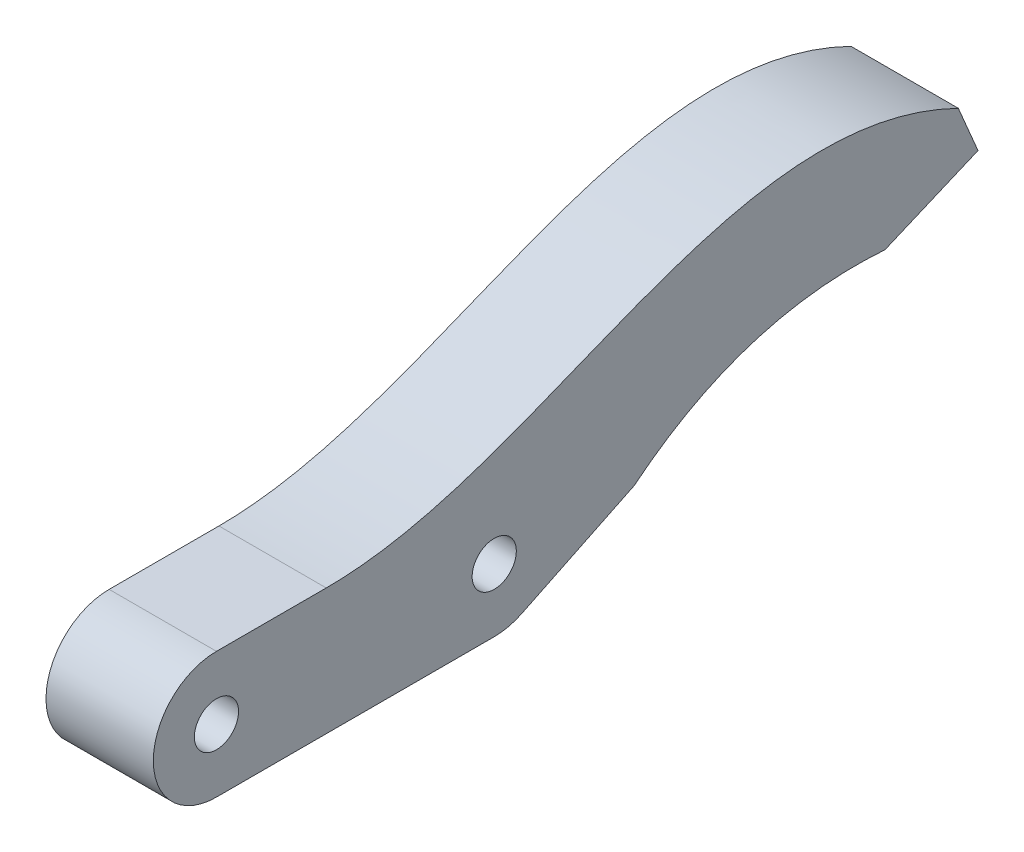
ISO-10303-21;
HEADER;
FILE_DESCRIPTION(('STEP AP214'),'2;1');
FILE_NAME('part.step','',(''),(''),'','','');
FILE_SCHEMA(('AUTOMOTIVE_DESIGN { 1 0 10303 214 1 1 1 1 }'));
ENDSEC;
DATA;
#1=APPLICATION_CONTEXT('core data for automotive mechanical design processes');
#2=APPLICATION_PROTOCOL_DEFINITION('international standard','automotive_design',2000,#1);
#3=PRODUCT_CONTEXT('',#1,'mechanical');
#4=PRODUCT('Part','Part','',(#3));
#5=PRODUCT_RELATED_PRODUCT_CATEGORY('part','',(#4));
#6=PRODUCT_DEFINITION_FORMATION('','',#4);
#7=PRODUCT_DEFINITION_CONTEXT('part definition',#1,'design');
#8=PRODUCT_DEFINITION('design','',#6,#7);
#9=PRODUCT_DEFINITION_SHAPE('','',#8);
#10=(LENGTH_UNIT() NAMED_UNIT(*) SI_UNIT(.MILLI.,.METRE.));
#11=(NAMED_UNIT(*) PLANE_ANGLE_UNIT() SI_UNIT($,.RADIAN.));
#12=(NAMED_UNIT(*) SI_UNIT($,.STERADIAN.) SOLID_ANGLE_UNIT());
#13=UNCERTAINTY_MEASURE_WITH_UNIT(LENGTH_MEASURE(1.E-05),#10,'distance_accuracy_value','');
#14=(GEOMETRIC_REPRESENTATION_CONTEXT(3) GLOBAL_UNCERTAINTY_ASSIGNED_CONTEXT((#13)) GLOBAL_UNIT_ASSIGNED_CONTEXT((#10,
#11,#12)) REPRESENTATION_CONTEXT('',''));
#15=CARTESIAN_POINT('',(0.,0.,0.));
#16=DIRECTION('',(0.,0.,1.));
#17=DIRECTION('',(1.,0.,0.));
#18=AXIS2_PLACEMENT_3D('',#15,#16,#17);
#19=CARTESIAN_POINT('',(8.5,5.,-27.));
#20=DIRECTION('',(-1.,0.,0.));
#21=DIRECTION('',(0.,0.,1.));
#22=AXIS2_PLACEMENT_3D('',#19,#20,#21);
#23=CYLINDRICAL_SURFACE('',#22,5.);
#24=DIRECTION('',(1.,0.,0.));
#25=VECTOR('',#24,1.);
#26=CARTESIAN_POINT('',(0.,0.502127655445501,-29.1838370754458));
#27=LINE('',#26,#25);
#28=CARTESIAN_POINT('',(0.,0.502127655445501,-29.1838370754458));
#29=VERTEX_POINT('',#28);
#30=CARTESIAN_POINT('',(8.5,0.502127655445501,-29.1838370754458));
#31=VERTEX_POINT('',#30);
#32=EDGE_CURVE('E194',#29,#31,#27,.T.);
#33=ORIENTED_EDGE('',*,*,#32,.T.);
#34=CARTESIAN_POINT('',(8.5,5.,-27.));
#35=DIRECTION('',(1.,0.,0.));
#36=DIRECTION('',(0.,0.,-1.));
#37=AXIS2_PLACEMENT_3D('',#34,#35,#36);
#38=CIRCLE('',#37,5.);
#39=CARTESIAN_POINT('',(8.5,0.,-27.));
#40=VERTEX_POINT('',#39);
#41=EDGE_CURVE('E206',#40,#31,#38,.T.);
#42=ORIENTED_EDGE('',*,*,#41,.F.);
#43=DIRECTION('',(-1.,0.,0.));
#44=VECTOR('',#43,1.);
#45=CARTESIAN_POINT('',(8.5,0.,-27.));
#46=LINE('',#45,#44);
#47=CARTESIAN_POINT('',(0.,0.,-27.));
#48=VERTEX_POINT('',#47);
#49=EDGE_CURVE('E214',#40,#48,#46,.T.);
#50=ORIENTED_EDGE('',*,*,#49,.T.);
#51=CARTESIAN_POINT('',(0.,5.,-27.));
#52=DIRECTION('',(1.,0.,0.));
#53=DIRECTION('',(0.,0.,-1.));
#54=AXIS2_PLACEMENT_3D('',#51,#52,#53);
#55=CIRCLE('',#54,5.);
#56=EDGE_CURVE('E218',#48,#29,#55,.T.);
#57=ORIENTED_EDGE('',*,*,#56,.T.);
#58=EDGE_LOOP('',(#33,#42,#50,#57));
#59=FACE_BOUND('',#58,.T.);
#60=ADVANCED_FACE('F39',(#59),#23,.T.);
#61=CARTESIAN_POINT('',(8.5,10.,0.));
#62=DIRECTION('',(0.,1.,0.));
#63=DIRECTION('',(0.,0.,1.));
#64=AXIS2_PLACEMENT_3D('',#61,#62,#63);
#65=PLANE('',#64);
#66=DIRECTION('',(1.,0.,0.));
#67=VECTOR('',#66,1.);
#68=CARTESIAN_POINT('',(0.,10.,-13.6949747586838));
#69=LINE('',#68,#67);
#70=CARTESIAN_POINT('',(0.,10.,-13.6949747586838));
#71=VERTEX_POINT('',#70);
#72=CARTESIAN_POINT('',(8.5,10.,-13.6949747586838));
#73=VERTEX_POINT('',#72);
#74=EDGE_CURVE('E129',#71,#73,#69,.T.);
#75=ORIENTED_EDGE('',*,*,#74,.F.);
#76=DIRECTION('',(0.,0.,-1.));
#77=VECTOR('',#76,1.);
#78=CARTESIAN_POINT('',(0.,10.,0.));
#79=LINE('',#78,#77);
#80=CARTESIAN_POINT('',(0.,10.,-5.));
#81=VERTEX_POINT('',#80);
#82=EDGE_CURVE('E140',#81,#71,#79,.T.);
#83=ORIENTED_EDGE('',*,*,#82,.F.);
#84=DIRECTION('',(-1.,0.,0.));
#85=VECTOR('',#84,1.);
#86=CARTESIAN_POINT('',(8.5,10.,-5.));
#87=LINE('',#86,#85);
#88=CARTESIAN_POINT('',(8.5,10.,-5.));
#89=VERTEX_POINT('',#88);
#90=EDGE_CURVE('E11',#89,#81,#87,.T.);
#91=ORIENTED_EDGE('',*,*,#90,.F.);
#92=DIRECTION('',(0.,0.,-1.));
#93=VECTOR('',#92,1.);
#94=CARTESIAN_POINT('',(8.5,10.,0.));
#95=LINE('',#94,#93);
#96=EDGE_CURVE('E193',#89,#73,#95,.T.);
#97=ORIENTED_EDGE('',*,*,#96,.T.);
#98=EDGE_LOOP('',(#75,#83,#91,#97));
#99=FACE_BOUND('',#98,.T.);
#100=ADVANCED_FACE('F41',(#99),#65,.T.);
#101=CARTESIAN_POINT('',(8.5,5.,-5.));
#102=DIRECTION('',(-1.,0.,0.));
#103=DIRECTION('',(0.,0.,1.));
#104=AXIS2_PLACEMENT_3D('',#101,#102,#103);
#105=CYLINDRICAL_SURFACE('',#104,5.);
#106=CARTESIAN_POINT('',(0.,5.,-5.));
#107=DIRECTION('',(1.,0.,0.));
#108=DIRECTION('',(0.,0.,-1.));
#109=AXIS2_PLACEMENT_3D('',#106,#107,#108);
#110=CIRCLE('',#109,5.);
#111=CARTESIAN_POINT('',(0.,0.,-5.));
#112=VERTEX_POINT('',#111);
#113=EDGE_CURVE('E69',#81,#112,#110,.T.);
#114=ORIENTED_EDGE('',*,*,#113,.T.);
#115=DIRECTION('',(-1.,0.,0.));
#116=VECTOR('',#115,1.);
#117=CARTESIAN_POINT('',(8.5,0.,-5.));
#118=LINE('',#117,#116);
#119=CARTESIAN_POINT('',(8.5,0.,-5.));
#120=VERTEX_POINT('',#119);
#121=EDGE_CURVE('E48',#120,#112,#118,.T.);
#122=ORIENTED_EDGE('',*,*,#121,.F.);
#123=CARTESIAN_POINT('',(8.5,5.,-5.));
#124=DIRECTION('',(1.,0.,0.));
#125=DIRECTION('',(0.,0.,-1.));
#126=AXIS2_PLACEMENT_3D('',#123,#124,#125);
#127=CIRCLE('',#126,5.);
#128=EDGE_CURVE('E202',#89,#120,#127,.T.);
#129=ORIENTED_EDGE('',*,*,#128,.F.);
#130=ORIENTED_EDGE('',*,*,#90,.T.);
#131=EDGE_LOOP('',(#114,#122,#129,#130));
#132=FACE_BOUND('',#131,.T.);
#133=ADVANCED_FACE('F185',(#132),#105,.T.);
#134=CARTESIAN_POINT('',(8.5,0.,0.));
#135=DIRECTION('',(0.,1.,0.));
#136=DIRECTION('',(0.,0.,1.));
#137=AXIS2_PLACEMENT_3D('',#134,#135,#136);
#138=PLANE('',#137);
#139=DIRECTION('',(0.,0.,-1.));
#140=VECTOR('',#139,1.);
#141=CARTESIAN_POINT('',(0.,0.,0.));
#142=LINE('',#141,#140);
#143=EDGE_CURVE('E74',#112,#48,#142,.T.);
#144=ORIENTED_EDGE('',*,*,#143,.T.);
#145=ORIENTED_EDGE('',*,*,#49,.F.);
#146=DIRECTION('',(0.,0.,-1.));
#147=VECTOR('',#146,1.);
#148=CARTESIAN_POINT('',(8.5,0.,0.));
#149=LINE('',#148,#147);
#150=EDGE_CURVE('E56',#120,#40,#149,.T.);
#151=ORIENTED_EDGE('',*,*,#150,.F.);
#152=ORIENTED_EDGE('',*,*,#121,.T.);
#153=EDGE_LOOP('',(#144,#145,#151,#152));
#154=FACE_BOUND('',#153,.T.);
#155=ADVANCED_FACE('F179',(#154),#138,.F.);
#156=CARTESIAN_POINT('',(8.5,5.,-5.));
#157=DIRECTION('',(-1.,0.,0.));
#158=DIRECTION('',(0.,0.,1.));
#159=AXIS2_PLACEMENT_3D('',#156,#157,#158);
#160=CYLINDRICAL_SURFACE('',#159,1.75);
#161=CARTESIAN_POINT('',(8.5,5.,-5.));
#162=DIRECTION('',(1.,0.,0.));
#163=DIRECTION('',(0.,0.,-1.));
#164=AXIS2_PLACEMENT_3D('',#161,#162,#163);
#165=CIRCLE('',#164,1.75);
#166=CARTESIAN_POINT('',(8.5,5.,-6.75));
#167=VERTEX_POINT('',#166);
#168=EDGE_CURVE('E208',#167,#167,#165,.T.);
#169=ORIENTED_EDGE('',*,*,#168,.T.);
#170=EDGE_LOOP('',(#169));
#171=FACE_BOUND('',#170,.T.);
#172=CARTESIAN_POINT('',(0.,5.,-5.));
#173=DIRECTION('',(1.,0.,0.));
#174=DIRECTION('',(0.,0.,-1.));
#175=AXIS2_PLACEMENT_3D('',#172,#173,#174);
#176=CIRCLE('',#175,1.75);
#177=CARTESIAN_POINT('',(0.,5.,-6.75));
#178=VERTEX_POINT('',#177);
#179=EDGE_CURVE('E221',#178,#178,#176,.T.);
#180=ORIENTED_EDGE('',*,*,#179,.F.);
#181=EDGE_LOOP('',(#180));
#182=FACE_BOUND('',#181,.T.);
#183=ADVANCED_FACE('F175',(#171,#182),#160,.F.);
#184=CARTESIAN_POINT('',(8.5,5.,-27.));
#185=DIRECTION('',(-1.,0.,0.));
#186=DIRECTION('',(0.,0.,1.));
#187=AXIS2_PLACEMENT_3D('',#184,#185,#186);
#188=CYLINDRICAL_SURFACE('',#187,1.75);
#189=CARTESIAN_POINT('',(8.5,5.,-27.));
#190=DIRECTION('',(1.,0.,0.));
#191=DIRECTION('',(0.,0.,-1.));
#192=AXIS2_PLACEMENT_3D('',#189,#190,#191);
#193=CIRCLE('',#192,1.75);
#194=CARTESIAN_POINT('',(8.5,5.,-28.75));
#195=VERTEX_POINT('',#194);
#196=EDGE_CURVE('E211',#195,#195,#193,.T.);
#197=ORIENTED_EDGE('',*,*,#196,.T.);
#198=EDGE_LOOP('',(#197));
#199=FACE_BOUND('',#198,.T.);
#200=CARTESIAN_POINT('',(0.,5.,-27.));
#201=DIRECTION('',(1.,0.,0.));
#202=DIRECTION('',(0.,0.,-1.));
#203=AXIS2_PLACEMENT_3D('',#200,#201,#202);
#204=CIRCLE('',#203,1.75);
#205=CARTESIAN_POINT('',(0.,5.,-28.75));
#206=VERTEX_POINT('',#205);
#207=EDGE_CURVE('E203',#206,#206,#204,.T.);
#208=ORIENTED_EDGE('',*,*,#207,.F.);
#209=EDGE_LOOP('',(#208));
#210=FACE_BOUND('',#209,.T.);
#211=ADVANCED_FACE('F170',(#199,#210),#188,.F.);
#212=CARTESIAN_POINT('',(8.5,0.,0.));
#213=DIRECTION('',(1.,0.,0.));
#214=DIRECTION('',(0.,0.,-1.));
#215=AXIS2_PLACEMENT_3D('',#212,#213,#214);
#216=PLANE('',#215);
#217=ORIENTED_EDGE('',*,*,#96,.F.);
#218=ORIENTED_EDGE('',*,*,#128,.T.);
#219=ORIENTED_EDGE('',*,*,#150,.T.);
#220=ORIENTED_EDGE('',*,*,#41,.T.);
#221=DIRECTION('',(0.,0.436767415089167,-0.8995744689109));
#222=VECTOR('',#221,1.);
#223=CARTESIAN_POINT('',(8.5,-11.0601312365663,-5.36998891997289));
#224=LINE('',#223,#222);
#225=CARTESIAN_POINT('',(8.5,4.82408407678908,-38.0854206599091));
#226=VERTEX_POINT('',#225);
#227=EDGE_CURVE('E234',#31,#226,#224,.T.);
#228=ORIENTED_EDGE('',*,*,#227,.T.);
#229=CARTESIAN_POINT('',(8.5,4.82408407678908,-38.0854206599091));
#230=CARTESIAN_POINT('',(8.5,11.8952224566425,-46.7975095094647));
#231=CARTESIAN_POINT('',(8.5,11.0678436667493,-57.9480004086976));
#232=B_SPLINE_CURVE_WITH_KNOTS('',2,(#229,#230,#231),.UNSPECIFIED.,.F.,.F.,(3,3),(0.,1.),.UNSPECIFIED.);
#233=CARTESIAN_POINT('',(8.5,11.0678436667493,-57.9480004086976));
#234=VERTEX_POINT('',#233);
#235=EDGE_CURVE('E148',#226,#234,#232,.T.);
#236=ORIENTED_EDGE('',*,*,#235,.T.);
#237=DIRECTION('',(0.,0.39020935118337,-0.920726160293631));
#238=VECTOR('',#237,1.);
#239=CARTESIAN_POINT('',(8.5,-11.4367064909869,-4.84694582599828));
#240=LINE('',#239,#238);
#241=CARTESIAN_POINT('',(8.5,14.1895184762162,-65.3138096910467));
#242=VERTEX_POINT('',#241);
#243=EDGE_CURVE('E145',#234,#242,#240,.T.);
#244=ORIENTED_EDGE('',*,*,#243,.T.);
#245=DIRECTION('',(0.,0.920726160293631,0.39020935118337));
#246=VECTOR('',#245,1.);
#247=CARTESIAN_POINT('',(8.5,25.6262249672031,-60.4668638650484));
#248=LINE('',#247,#246);
#249=CARTESIAN_POINT('',(8.5,17.8724231173908,-63.7529722863132));
#250=VERTEX_POINT('',#249);
#251=EDGE_CURVE('E240',#242,#250,#248,.T.);
#252=ORIENTED_EDGE('',*,*,#251,.T.);
#253=CARTESIAN_POINT('',(8.5,17.8724231173908,-63.7529722863132));
#254=CARTESIAN_POINT('',(8.5,26.563787962677,-45.9288826779558));
#255=CARTESIAN_POINT('',(8.5,10.,-31.059268620705));
#256=CARTESIAN_POINT('',(8.5,10.,-13.6949747586838));
#257=B_SPLINE_CURVE_WITH_KNOTS('',3,(#253,#254,#255,#256),.UNSPECIFIED.,.F.,.F.,(4,4),(0.,1.),.UNSPECIFIED.);
#258=EDGE_CURVE('E124',#250,#73,#257,.T.);
#259=ORIENTED_EDGE('',*,*,#258,.T.);
#260=EDGE_LOOP('',(#217,#218,#219,#220,#228,#236,#244,#252,#259));
#261=FACE_BOUND('',#260,.T.);
#262=ORIENTED_EDGE('',*,*,#168,.F.);
#263=EDGE_LOOP('',(#262));
#264=FACE_BOUND('',#263,.T.);
#265=ORIENTED_EDGE('',*,*,#196,.F.);
#266=EDGE_LOOP('',(#265));
#267=FACE_BOUND('',#266,.T.);
#268=ADVANCED_FACE('F167',(#261,#264,#267),#216,.T.);
#269=CARTESIAN_POINT('',(0.,0.,0.));
#270=DIRECTION('',(1.,0.,0.));
#271=DIRECTION('',(0.,0.,-1.));
#272=AXIS2_PLACEMENT_3D('',#269,#270,#271);
#273=PLANE('',#272);
#274=ORIENTED_EDGE('',*,*,#82,.T.);
#275=CARTESIAN_POINT('',(0.,17.8724231173908,-63.7529722863132));
#276=CARTESIAN_POINT('',(0.,26.563787962677,-45.9288826779558));
#277=CARTESIAN_POINT('',(0.,10.,-31.059268620705));
#278=CARTESIAN_POINT('',(0.,10.,-13.6949747586838));
#279=B_SPLINE_CURVE_WITH_KNOTS('',3,(#275,#276,#277,#278),.UNSPECIFIED.,.F.,.F.,(4,4),(0.,1.),.UNSPECIFIED.);
#280=CARTESIAN_POINT('',(0.,17.8724231173908,-63.7529722863132));
#281=VERTEX_POINT('',#280);
#282=EDGE_CURVE('E121',#281,#71,#279,.T.);
#283=ORIENTED_EDGE('',*,*,#282,.F.);
#284=DIRECTION('',(0.,0.920726160293631,0.39020935118337));
#285=VECTOR('',#284,1.);
#286=CARTESIAN_POINT('',(0.,25.6262249672031,-60.4668638650484));
#287=LINE('',#286,#285);
#288=CARTESIAN_POINT('',(0.,14.1895184762162,-65.3138096910467));
#289=VERTEX_POINT('',#288);
#290=EDGE_CURVE('E138',#289,#281,#287,.T.);
#291=ORIENTED_EDGE('',*,*,#290,.F.);
#292=DIRECTION('',(0.,0.39020935118337,-0.920726160293631));
#293=VECTOR('',#292,1.);
#294=CARTESIAN_POINT('',(0.,-11.4367064909869,-4.84694582599828));
#295=LINE('',#294,#293);
#296=CARTESIAN_POINT('',(0.,11.0678436667493,-57.9480004086976));
#297=VERTEX_POINT('',#296);
#298=EDGE_CURVE('E130',#297,#289,#295,.T.);
#299=ORIENTED_EDGE('',*,*,#298,.F.);
#300=CARTESIAN_POINT('',(0.,4.82408407678908,-38.0854206599091));
#301=CARTESIAN_POINT('',(0.,11.8952224566425,-46.7975095094647));
#302=CARTESIAN_POINT('',(0.,11.0678436667493,-57.9480004086976));
#303=B_SPLINE_CURVE_WITH_KNOTS('',2,(#300,#301,#302),.UNSPECIFIED.,.F.,.F.,(3,3),(0.,1.),.UNSPECIFIED.);
#304=CARTESIAN_POINT('',(0.,4.82408407678908,-38.0854206599091));
#305=VERTEX_POINT('',#304);
#306=EDGE_CURVE('E256',#305,#297,#303,.T.);
#307=ORIENTED_EDGE('',*,*,#306,.F.);
#308=DIRECTION('',(0.,0.436767415089167,-0.8995744689109));
#309=VECTOR('',#308,1.);
#310=CARTESIAN_POINT('',(0.,-11.0601312365663,-5.36998891997289));
#311=LINE('',#310,#309);
#312=EDGE_CURVE('E141',#29,#305,#311,.T.);
#313=ORIENTED_EDGE('',*,*,#312,.F.);
#314=ORIENTED_EDGE('',*,*,#56,.F.);
#315=ORIENTED_EDGE('',*,*,#143,.F.);
#316=ORIENTED_EDGE('',*,*,#113,.F.);
#317=EDGE_LOOP('',(#274,#283,#291,#299,#307,#313,#314,#315,#316));
#318=FACE_BOUND('',#317,.T.);
#319=ORIENTED_EDGE('',*,*,#179,.T.);
#320=EDGE_LOOP('',(#319));
#321=FACE_BOUND('',#320,.T.);
#322=ORIENTED_EDGE('',*,*,#207,.T.);
#323=EDGE_LOOP('',(#322));
#324=FACE_BOUND('',#323,.T.);
#325=ADVANCED_FACE('F135',(#318,#321,#324),#273,.F.);
#326=CARTESIAN_POINT('',(0.,25.6262249672031,-60.4668638650484));
#327=DIRECTION('',(0.,0.39020935118337,-0.920726160293631));
#328=DIRECTION('',(0.,0.920726160293631,0.39020935118337));
#329=AXIS2_PLACEMENT_3D('',#326,#327,#328);
#330=PLANE('',#329);
#331=ORIENTED_EDGE('',*,*,#251,.F.);
#332=DIRECTION('',(1.,0.,0.));
#333=VECTOR('',#332,1.);
#334=CARTESIAN_POINT('',(0.,14.1895184762162,-65.3138096910467));
#335=LINE('',#334,#333);
#336=EDGE_CURVE('E144',#289,#242,#335,.T.);
#337=ORIENTED_EDGE('',*,*,#336,.F.);
#338=ORIENTED_EDGE('',*,*,#290,.T.);
#339=DIRECTION('',(1.,0.,0.));
#340=VECTOR('',#339,1.);
#341=CARTESIAN_POINT('',(0.,17.8724231173908,-63.7529722863132));
#342=LINE('',#341,#340);
#343=EDGE_CURVE('E118',#281,#250,#342,.T.);
#344=ORIENTED_EDGE('',*,*,#343,.T.);
#345=EDGE_LOOP('',(#331,#337,#338,#344));
#346=FACE_BOUND('',#345,.T.);
#347=ADVANCED_FACE('F143',(#346),#330,.T.);
#348=CARTESIAN_POINT('',(0.,-11.4367064909869,-4.84694582599828));
#349=DIRECTION('',(0.,-0.920726160293631,-0.39020935118337));
#350=DIRECTION('',(0.,0.39020935118337,-0.920726160293631));
#351=AXIS2_PLACEMENT_3D('',#348,#349,#350);
#352=PLANE('',#351);
#353=ORIENTED_EDGE('',*,*,#243,.F.);
#354=DIRECTION('',(1.,0.,0.));
#355=VECTOR('',#354,1.);
#356=CARTESIAN_POINT('',(0.,11.0678436667493,-57.9480004086976));
#357=LINE('',#356,#355);
#358=EDGE_CURVE('E252',#297,#234,#357,.T.);
#359=ORIENTED_EDGE('',*,*,#358,.F.);
#360=ORIENTED_EDGE('',*,*,#298,.T.);
#361=ORIENTED_EDGE('',*,*,#336,.T.);
#362=EDGE_LOOP('',(#353,#359,#360,#361));
#363=FACE_BOUND('',#362,.T.);
#364=ADVANCED_FACE('F166',(#363),#352,.T.);
#365=DIRECTION('',(1.,0.,0.));
#366=VECTOR('',#365,1.);
#367=SURFACE_OF_LINEAR_EXTRUSION('',#303,#366);
#368=ORIENTED_EDGE('',*,*,#235,.F.);
#369=DIRECTION('',(1.,0.,0.));
#370=VECTOR('',#369,1.);
#371=CARTESIAN_POINT('',(0.,4.82408407678908,-38.0854206599091));
#372=LINE('',#371,#370);
#373=EDGE_CURVE('E197',#305,#226,#372,.T.);
#374=ORIENTED_EDGE('',*,*,#373,.F.);
#375=ORIENTED_EDGE('',*,*,#306,.T.);
#376=ORIENTED_EDGE('',*,*,#358,.T.);
#377=EDGE_LOOP('',(#368,#374,#375,#376));
#378=FACE_BOUND('',#377,.T.);
#379=ADVANCED_FACE('F255',(#378),#367,.T.);
#380=CARTESIAN_POINT('',(0.,-11.0601312365663,-5.36998891997289));
#381=DIRECTION('',(0.,-0.8995744689109,-0.436767415089167));
#382=DIRECTION('',(0.,0.436767415089167,-0.8995744689109));
#383=AXIS2_PLACEMENT_3D('',#380,#381,#382);
#384=PLANE('',#383);
#385=ORIENTED_EDGE('',*,*,#227,.F.);
#386=ORIENTED_EDGE('',*,*,#32,.F.);
#387=ORIENTED_EDGE('',*,*,#312,.T.);
#388=ORIENTED_EDGE('',*,*,#373,.T.);
#389=EDGE_LOOP('',(#385,#386,#387,#388));
#390=FACE_BOUND('',#389,.T.);
#391=ADVANCED_FACE('F162',(#390),#384,.T.);
#392=DIRECTION('',(1.,0.,0.));
#393=VECTOR('',#392,1.);
#394=SURFACE_OF_LINEAR_EXTRUSION('',#279,#393);
#395=ORIENTED_EDGE('',*,*,#258,.F.);
#396=ORIENTED_EDGE('',*,*,#343,.F.);
#397=ORIENTED_EDGE('',*,*,#282,.T.);
#398=ORIENTED_EDGE('',*,*,#74,.T.);
#399=EDGE_LOOP('',(#395,#396,#397,#398));
#400=FACE_BOUND('',#399,.T.);
#401=ADVANCED_FACE('F120',(#400),#394,.T.);
#402=CLOSED_SHELL('',(#60,#100,#133,#155,#183,#211,#268,#325,#347,#364,#379,#391,#401));
#403=MANIFOLD_SOLID_BREP('B2',#402);
#404=ADVANCED_BREP_SHAPE_REPRESENTATION('',(#18,#403),#14);
#405=SHAPE_DEFINITION_REPRESENTATION(#9,#404);
ENDSEC;
END-ISO-10303-21;
